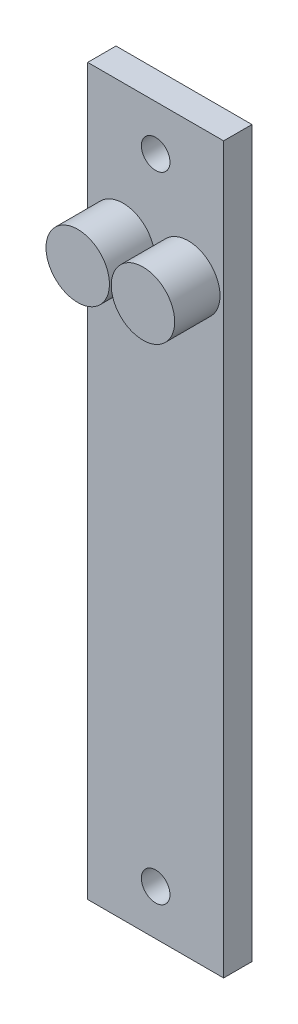
ISO-10303-21;
HEADER;
FILE_DESCRIPTION(('STEP AP214'),'2;1');
FILE_NAME('part.step','',(''),(''),'','','');
FILE_SCHEMA(('AUTOMOTIVE_DESIGN { 1 0 10303 214 1 1 1 1 }'));
ENDSEC;
DATA;
#1=APPLICATION_CONTEXT('core data for automotive mechanical design processes');
#2=APPLICATION_PROTOCOL_DEFINITION('international standard','automotive_design',2000,#1);
#3=PRODUCT_CONTEXT('',#1,'mechanical');
#4=PRODUCT('Part','Part','',(#3));
#5=PRODUCT_RELATED_PRODUCT_CATEGORY('part','',(#4));
#6=PRODUCT_DEFINITION_FORMATION('','',#4);
#7=PRODUCT_DEFINITION_CONTEXT('part definition',#1,'design');
#8=PRODUCT_DEFINITION('design','',#6,#7);
#9=PRODUCT_DEFINITION_SHAPE('','',#8);
#10=(LENGTH_UNIT() NAMED_UNIT(*) SI_UNIT(.MILLI.,.METRE.));
#11=(NAMED_UNIT(*) PLANE_ANGLE_UNIT() SI_UNIT($,.RADIAN.));
#12=(NAMED_UNIT(*) SI_UNIT($,.STERADIAN.) SOLID_ANGLE_UNIT());
#13=UNCERTAINTY_MEASURE_WITH_UNIT(LENGTH_MEASURE(1.E-05),#10,'distance_accuracy_value','');
#14=(GEOMETRIC_REPRESENTATION_CONTEXT(3) GLOBAL_UNCERTAINTY_ASSIGNED_CONTEXT((#13)) GLOBAL_UNIT_ASSIGNED_CONTEXT((#10,
#11,#12)) REPRESENTATION_CONTEXT('',''));
#15=CARTESIAN_POINT('',(0.,0.,0.));
#16=DIRECTION('',(0.,0.,1.));
#17=DIRECTION('',(1.,0.,0.));
#18=AXIS2_PLACEMENT_3D('',#15,#16,#17);
#19=CARTESIAN_POINT('',(0.,0.,7.9375));
#20=DIRECTION('',(0.,0.,1.));
#21=DIRECTION('',(1.,0.,0.));
#22=AXIS2_PLACEMENT_3D('',#19,#20,#21);
#23=PLANE('',#22);
#24=CARTESIAN_POINT('',(-9.14400000000002,63.5,7.9375));
#25=DIRECTION('',(0.,0.,1.));
#26=DIRECTION('',(1.,0.,0.));
#27=AXIS2_PLACEMENT_3D('',#24,#25,#26);
#28=CIRCLE('',#27,8.89);
#29=CARTESIAN_POINT('',(-0.25400000000002,63.5,7.9375));
#30=VERTEX_POINT('',#29);
#31=EDGE_CURVE('E126',#30,#30,#28,.T.);
#32=ORIENTED_EDGE('',*,*,#31,.F.);
#33=EDGE_LOOP('',(#32));
#34=FACE_BOUND('',#33,.T.);
#35=CARTESIAN_POINT('',(0.,-88.9,7.9375));
#36=DIRECTION('',(0.,0.,1.));
#37=DIRECTION('',(1.,0.,0.));
#38=AXIS2_PLACEMENT_3D('',#35,#36,#37);
#39=CIRCLE('',#38,4.0132);
#40=CARTESIAN_POINT('',(4.0132,-88.9,7.9375));
#41=VERTEX_POINT('',#40);
#42=EDGE_CURVE('E122',#41,#41,#39,.T.);
#43=ORIENTED_EDGE('',*,*,#42,.F.);
#44=EDGE_LOOP('',(#43));
#45=FACE_BOUND('',#44,.T.);
#46=CARTESIAN_POINT('',(0.,88.9,7.9375));
#47=DIRECTION('',(0.,0.,1.));
#48=DIRECTION('',(1.,0.,0.));
#49=AXIS2_PLACEMENT_3D('',#46,#47,#48);
#50=CIRCLE('',#49,4.0132);
#51=CARTESIAN_POINT('',(4.0132,88.9,7.9375));
#52=VERTEX_POINT('',#51);
#53=EDGE_CURVE('E116',#52,#52,#50,.T.);
#54=ORIENTED_EDGE('',*,*,#53,.F.);
#55=EDGE_LOOP('',(#54));
#56=FACE_BOUND('',#55,.T.);
#57=DIRECTION('',(0.,-1.,0.));
#58=VECTOR('',#57,1.);
#59=CARTESIAN_POINT('',(-19.05,101.6,7.9375));
#60=LINE('',#59,#58);
#61=CARTESIAN_POINT('',(-19.05,101.6,7.9375));
#62=VERTEX_POINT('',#61);
#63=CARTESIAN_POINT('',(-19.05,-101.6,7.9375));
#64=VERTEX_POINT('',#63);
#65=EDGE_CURVE('E88',#62,#64,#60,.T.);
#66=ORIENTED_EDGE('',*,*,#65,.T.);
#67=DIRECTION('',(1.,0.,0.));
#68=VECTOR('',#67,1.);
#69=CARTESIAN_POINT('',(-19.05,-101.6,7.9375));
#70=LINE('',#69,#68);
#71=CARTESIAN_POINT('',(19.05,-101.6,7.9375));
#72=VERTEX_POINT('',#71);
#73=EDGE_CURVE('E83',#64,#72,#70,.T.);
#74=ORIENTED_EDGE('',*,*,#73,.T.);
#75=DIRECTION('',(0.,1.,0.));
#76=VECTOR('',#75,1.);
#77=CARTESIAN_POINT('',(19.05,101.6,7.9375));
#78=LINE('',#77,#76);
#79=CARTESIAN_POINT('',(19.05,101.6,7.9375));
#80=VERTEX_POINT('',#79);
#81=EDGE_CURVE('E86',#72,#80,#78,.T.);
#82=ORIENTED_EDGE('',*,*,#81,.T.);
#83=DIRECTION('',(-1.,0.,0.));
#84=VECTOR('',#83,1.);
#85=CARTESIAN_POINT('',(-19.05,101.6,7.9375));
#86=LINE('',#85,#84);
#87=EDGE_CURVE('E53',#80,#62,#86,.T.);
#88=ORIENTED_EDGE('',*,*,#87,.T.);
#89=EDGE_LOOP('',(#66,#74,#82,#88));
#90=FACE_BOUND('',#89,.T.);
#91=CARTESIAN_POINT('',(9.14400000000001,63.5,7.9375));
#92=DIRECTION('',(0.,0.,1.));
#93=DIRECTION('',(1.,0.,0.));
#94=AXIS2_PLACEMENT_3D('',#91,#92,#93);
#95=CIRCLE('',#94,8.89);
#96=CARTESIAN_POINT('',(18.034,63.5,7.9375));
#97=VERTEX_POINT('',#96);
#98=EDGE_CURVE('E132',#97,#97,#95,.T.);
#99=ORIENTED_EDGE('',*,*,#98,.F.);
#100=EDGE_LOOP('',(#99));
#101=FACE_BOUND('',#100,.T.);
#102=ADVANCED_FACE('F36',(#34,#45,#56,#90,#101),#23,.T.);
#103=CARTESIAN_POINT('',(-19.05,101.6,7.9375));
#104=DIRECTION('',(1.,0.,0.));
#105=DIRECTION('',(0.,1.,0.));
#106=AXIS2_PLACEMENT_3D('',#103,#104,#105);
#107=PLANE('',#106);
#108=DIRECTION('',(0.,-1.,0.));
#109=VECTOR('',#108,1.);
#110=CARTESIAN_POINT('',(-19.05,101.6,0.));
#111=LINE('',#110,#109);
#112=CARTESIAN_POINT('',(-19.05,101.6,0.));
#113=VERTEX_POINT('',#112);
#114=CARTESIAN_POINT('',(-19.05,-101.6,0.));
#115=VERTEX_POINT('',#114);
#116=EDGE_CURVE('E100',#113,#115,#111,.T.);
#117=ORIENTED_EDGE('',*,*,#116,.T.);
#118=DIRECTION('',(0.,0.,-1.));
#119=VECTOR('',#118,1.);
#120=CARTESIAN_POINT('',(-19.05,-101.6,7.9375));
#121=LINE('',#120,#119);
#122=EDGE_CURVE('E11',#64,#115,#121,.T.);
#123=ORIENTED_EDGE('',*,*,#122,.F.);
#124=ORIENTED_EDGE('',*,*,#65,.F.);
#125=DIRECTION('',(0.,0.,-1.));
#126=VECTOR('',#125,1.);
#127=CARTESIAN_POINT('',(-19.05,101.6,7.9375));
#128=LINE('',#127,#126);
#129=EDGE_CURVE('E96',#62,#113,#128,.T.);
#130=ORIENTED_EDGE('',*,*,#129,.T.);
#131=EDGE_LOOP('',(#117,#123,#124,#130));
#132=FACE_BOUND('',#131,.T.);
#133=ADVANCED_FACE('F38',(#132),#107,.F.);
#134=CARTESIAN_POINT('',(-19.05,-101.6,7.9375));
#135=DIRECTION('',(0.,1.,0.));
#136=DIRECTION('',(0.,0.,1.));
#137=AXIS2_PLACEMENT_3D('',#134,#135,#136);
#138=PLANE('',#137);
#139=DIRECTION('',(1.,0.,0.));
#140=VECTOR('',#139,1.);
#141=CARTESIAN_POINT('',(-19.05,-101.6,0.));
#142=LINE('',#141,#140);
#143=CARTESIAN_POINT('',(19.05,-101.6,0.));
#144=VERTEX_POINT('',#143);
#145=EDGE_CURVE('E92',#115,#144,#142,.T.);
#146=ORIENTED_EDGE('',*,*,#145,.T.);
#147=DIRECTION('',(0.,0.,-1.));
#148=VECTOR('',#147,1.);
#149=CARTESIAN_POINT('',(19.05,-101.6,7.9375));
#150=LINE('',#149,#148);
#151=EDGE_CURVE('E45',#72,#144,#150,.T.);
#152=ORIENTED_EDGE('',*,*,#151,.F.);
#153=ORIENTED_EDGE('',*,*,#73,.F.);
#154=ORIENTED_EDGE('',*,*,#122,.T.);
#155=EDGE_LOOP('',(#146,#152,#153,#154));
#156=FACE_BOUND('',#155,.T.);
#157=ADVANCED_FACE('F91',(#156),#138,.F.);
#158=CARTESIAN_POINT('',(19.05,101.6,7.9375));
#159=DIRECTION('',(-1.,0.,0.));
#160=DIRECTION('',(0.,-1.,0.));
#161=AXIS2_PLACEMENT_3D('',#158,#159,#160);
#162=PLANE('',#161);
#163=DIRECTION('',(0.,1.,0.));
#164=VECTOR('',#163,1.);
#165=CARTESIAN_POINT('',(19.05,101.6,0.));
#166=LINE('',#165,#164);
#167=CARTESIAN_POINT('',(19.05,101.6,0.));
#168=VERTEX_POINT('',#167);
#169=EDGE_CURVE('E70',#144,#168,#166,.T.);
#170=ORIENTED_EDGE('',*,*,#169,.T.);
#171=DIRECTION('',(0.,0.,-1.));
#172=VECTOR('',#171,1.);
#173=CARTESIAN_POINT('',(19.05,101.6,7.9375));
#174=LINE('',#173,#172);
#175=EDGE_CURVE('E93',#80,#168,#174,.T.);
#176=ORIENTED_EDGE('',*,*,#175,.F.);
#177=ORIENTED_EDGE('',*,*,#81,.F.);
#178=ORIENTED_EDGE('',*,*,#151,.T.);
#179=EDGE_LOOP('',(#170,#176,#177,#178));
#180=FACE_BOUND('',#179,.T.);
#181=ADVANCED_FACE('F94',(#180),#162,.F.);
#182=CARTESIAN_POINT('',(-19.05,101.6,7.9375));
#183=DIRECTION('',(0.,-1.,0.));
#184=DIRECTION('',(0.,0.,-1.));
#185=AXIS2_PLACEMENT_3D('',#182,#183,#184);
#186=PLANE('',#185);
#187=DIRECTION('',(-1.,0.,0.));
#188=VECTOR('',#187,1.);
#189=CARTESIAN_POINT('',(-19.05,101.6,0.));
#190=LINE('',#189,#188);
#191=EDGE_CURVE('E76',#168,#113,#190,.T.);
#192=ORIENTED_EDGE('',*,*,#191,.T.);
#193=ORIENTED_EDGE('',*,*,#129,.F.);
#194=ORIENTED_EDGE('',*,*,#87,.F.);
#195=ORIENTED_EDGE('',*,*,#175,.T.);
#196=EDGE_LOOP('',(#192,#193,#194,#195));
#197=FACE_BOUND('',#196,.T.);
#198=ADVANCED_FACE('F108',(#197),#186,.F.);
#199=CARTESIAN_POINT('',(0.,0.,0.));
#200=DIRECTION('',(0.,0.,1.));
#201=DIRECTION('',(1.,0.,0.));
#202=AXIS2_PLACEMENT_3D('',#199,#200,#201);
#203=PLANE('',#202);
#204=CARTESIAN_POINT('',(0.,-88.9,0.));
#205=DIRECTION('',(0.,0.,1.));
#206=DIRECTION('',(1.,0.,0.));
#207=AXIS2_PLACEMENT_3D('',#204,#205,#206);
#208=CIRCLE('',#207,4.0132);
#209=CARTESIAN_POINT('',(4.0132,-88.9,0.));
#210=VERTEX_POINT('',#209);
#211=EDGE_CURVE('E119',#210,#210,#208,.T.);
#212=ORIENTED_EDGE('',*,*,#211,.T.);
#213=EDGE_LOOP('',(#212));
#214=FACE_BOUND('',#213,.T.);
#215=CARTESIAN_POINT('',(0.,88.9,0.));
#216=DIRECTION('',(0.,0.,1.));
#217=DIRECTION('',(1.,0.,0.));
#218=AXIS2_PLACEMENT_3D('',#215,#216,#217);
#219=CIRCLE('',#218,4.0132);
#220=CARTESIAN_POINT('',(4.0132,88.9,0.));
#221=VERTEX_POINT('',#220);
#222=EDGE_CURVE('E103',#221,#221,#219,.T.);
#223=ORIENTED_EDGE('',*,*,#222,.T.);
#224=EDGE_LOOP('',(#223));
#225=FACE_BOUND('',#224,.T.);
#226=ORIENTED_EDGE('',*,*,#116,.F.);
#227=ORIENTED_EDGE('',*,*,#191,.F.);
#228=ORIENTED_EDGE('',*,*,#169,.F.);
#229=ORIENTED_EDGE('',*,*,#145,.F.);
#230=EDGE_LOOP('',(#226,#227,#228,#229));
#231=FACE_BOUND('',#230,.T.);
#232=ADVANCED_FACE('F111',(#214,#225,#231),#203,.F.);
#233=CARTESIAN_POINT('',(0.,88.9,7.9375));
#234=DIRECTION('',(0.,0.,1.));
#235=DIRECTION('',(1.,0.,0.));
#236=AXIS2_PLACEMENT_3D('',#233,#234,#235);
#237=CYLINDRICAL_SURFACE('',#236,4.0132);
#238=ORIENTED_EDGE('',*,*,#222,.F.);
#239=EDGE_LOOP('',(#238));
#240=FACE_BOUND('',#239,.T.);
#241=ORIENTED_EDGE('',*,*,#53,.T.);
#242=EDGE_LOOP('',(#241));
#243=FACE_BOUND('',#242,.T.);
#244=ADVANCED_FACE('F156',(#240,#243),#237,.F.);
#245=CARTESIAN_POINT('',(0.,-88.9,7.9375));
#246=DIRECTION('',(0.,0.,1.));
#247=DIRECTION('',(1.,0.,0.));
#248=AXIS2_PLACEMENT_3D('',#245,#246,#247);
#249=CYLINDRICAL_SURFACE('',#248,4.0132);
#250=ORIENTED_EDGE('',*,*,#211,.F.);
#251=EDGE_LOOP('',(#250));
#252=FACE_BOUND('',#251,.T.);
#253=ORIENTED_EDGE('',*,*,#42,.T.);
#254=EDGE_LOOP('',(#253));
#255=FACE_BOUND('',#254,.T.);
#256=ADVANCED_FACE('F188',(#252,#255),#249,.F.);
#257=CARTESIAN_POINT('',(-9.14400000000002,63.5,20.6375));
#258=DIRECTION('',(0.,0.,-1.));
#259=DIRECTION('',(-1.,0.,0.));
#260=AXIS2_PLACEMENT_3D('',#257,#258,#259);
#261=CYLINDRICAL_SURFACE('',#260,8.89);
#262=CARTESIAN_POINT('',(-9.14400000000002,63.5,20.6375));
#263=DIRECTION('',(0.,0.,1.));
#264=DIRECTION('',(1.,0.,0.));
#265=AXIS2_PLACEMENT_3D('',#262,#263,#264);
#266=CIRCLE('',#265,8.89);
#267=CARTESIAN_POINT('',(-0.25400000000002,63.5,20.6375));
#268=VERTEX_POINT('',#267);
#269=EDGE_CURVE('E125',#268,#268,#266,.T.);
#270=ORIENTED_EDGE('',*,*,#269,.F.);
#271=EDGE_LOOP('',(#270));
#272=FACE_BOUND('',#271,.T.);
#273=ORIENTED_EDGE('',*,*,#31,.T.);
#274=EDGE_LOOP('',(#273));
#275=FACE_BOUND('',#274,.T.);
#276=ADVANCED_FACE('F194',(#272,#275),#261,.T.);
#277=CARTESIAN_POINT('',(-9.14400000000002,63.5,20.6375));
#278=DIRECTION('',(0.,0.,1.));
#279=DIRECTION('',(1.,0.,0.));
#280=AXIS2_PLACEMENT_3D('',#277,#278,#279);
#281=PLANE('',#280);
#282=ORIENTED_EDGE('',*,*,#269,.T.);
#283=EDGE_LOOP('',(#282));
#284=FACE_BOUND('',#283,.T.);
#285=ADVANCED_FACE('F143',(#284),#281,.T.);
#286=CARTESIAN_POINT('',(9.14400000000001,63.5,20.6375));
#287=DIRECTION('',(0.,0.,-1.));
#288=DIRECTION('',(-1.,0.,0.));
#289=AXIS2_PLACEMENT_3D('',#286,#287,#288);
#290=CYLINDRICAL_SURFACE('',#289,8.89);
#291=CARTESIAN_POINT('',(9.14400000000001,63.5,20.6375));
#292=DIRECTION('',(0.,0.,1.));
#293=DIRECTION('',(1.,0.,0.));
#294=AXIS2_PLACEMENT_3D('',#291,#292,#293);
#295=CIRCLE('',#294,8.89);
#296=CARTESIAN_POINT('',(18.034,63.5,20.6375));
#297=VERTEX_POINT('',#296);
#298=EDGE_CURVE('E129',#297,#297,#295,.T.);
#299=ORIENTED_EDGE('',*,*,#298,.F.);
#300=EDGE_LOOP('',(#299));
#301=FACE_BOUND('',#300,.T.);
#302=ORIENTED_EDGE('',*,*,#98,.T.);
#303=EDGE_LOOP('',(#302));
#304=FACE_BOUND('',#303,.T.);
#305=ADVANCED_FACE('F140',(#301,#304),#290,.T.);
#306=CARTESIAN_POINT('',(9.14400000000001,63.5,20.6375));
#307=DIRECTION('',(0.,0.,1.));
#308=DIRECTION('',(1.,0.,0.));
#309=AXIS2_PLACEMENT_3D('',#306,#307,#308);
#310=PLANE('',#309);
#311=ORIENTED_EDGE('',*,*,#298,.T.);
#312=EDGE_LOOP('',(#311));
#313=FACE_BOUND('',#312,.T.);
#314=ADVANCED_FACE('F138',(#313),#310,.T.);
#315=CLOSED_SHELL('',(#102,#133,#157,#181,#198,#232,#244,#256,#276,#285,#305,#314));
#316=MANIFOLD_SOLID_BREP('B2',#315);
#317=ADVANCED_BREP_SHAPE_REPRESENTATION('',(#18,#316),#14);
#318=SHAPE_DEFINITION_REPRESENTATION(#9,#317);
ENDSEC;
END-ISO-10303-21;
